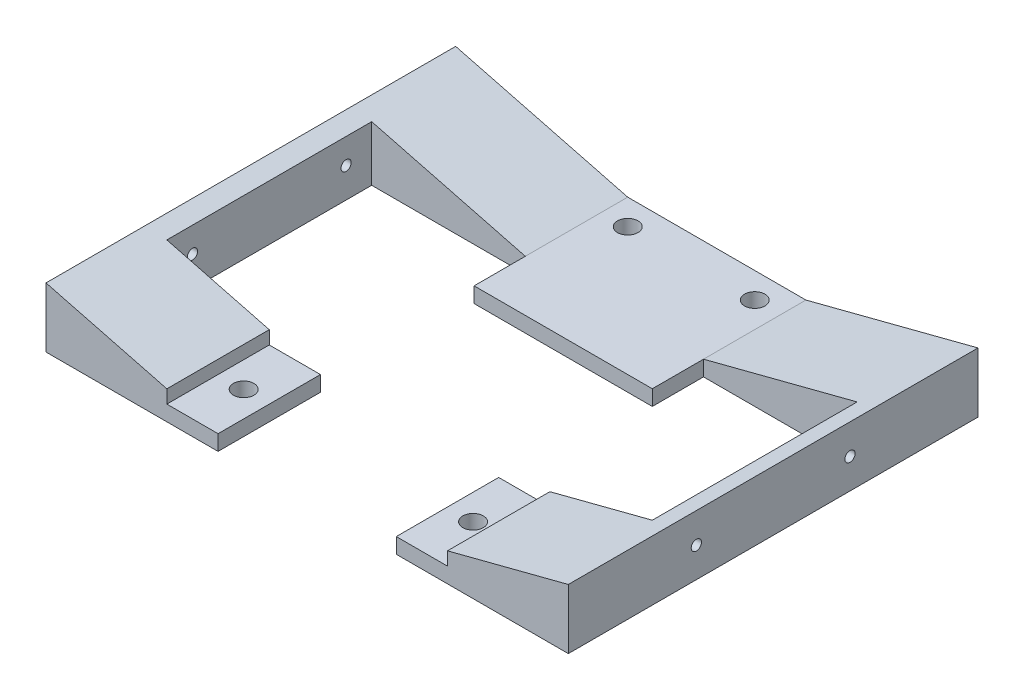
ISO-10303-21;
HEADER;
FILE_DESCRIPTION(('STEP AP214'),'2;1');
FILE_NAME('part.step','',(''),(''),'','','');
FILE_SCHEMA(('AUTOMOTIVE_DESIGN { 1 0 10303 214 1 1 1 1 }'));
ENDSEC;
DATA;
#1=APPLICATION_CONTEXT('core data for automotive mechanical design processes');
#2=APPLICATION_PROTOCOL_DEFINITION('international standard','automotive_design',2000,#1);
#3=PRODUCT_CONTEXT('',#1,'mechanical');
#4=PRODUCT('Part','Part','',(#3));
#5=PRODUCT_RELATED_PRODUCT_CATEGORY('part','',(#4));
#6=PRODUCT_DEFINITION_FORMATION('','',#4);
#7=PRODUCT_DEFINITION_CONTEXT('part definition',#1,'design');
#8=PRODUCT_DEFINITION('design','',#6,#7);
#9=PRODUCT_DEFINITION_SHAPE('','',#8);
#10=(LENGTH_UNIT() NAMED_UNIT(*) SI_UNIT(.MILLI.,.METRE.));
#11=(NAMED_UNIT(*) PLANE_ANGLE_UNIT() SI_UNIT($,.RADIAN.));
#12=(NAMED_UNIT(*) SI_UNIT($,.STERADIAN.) SOLID_ANGLE_UNIT());
#13=UNCERTAINTY_MEASURE_WITH_UNIT(LENGTH_MEASURE(1.E-05),#10,'distance_accuracy_value','');
#14=(GEOMETRIC_REPRESENTATION_CONTEXT(3) GLOBAL_UNCERTAINTY_ASSIGNED_CONTEXT((#13)) GLOBAL_UNIT_ASSIGNED_CONTEXT((#10,
#11,#12)) REPRESENTATION_CONTEXT('',''));
#15=CARTESIAN_POINT('',(0.,0.,0.));
#16=DIRECTION('',(0.,0.,1.));
#17=DIRECTION('',(1.,0.,0.));
#18=AXIS2_PLACEMENT_3D('',#15,#16,#17);
#19=CARTESIAN_POINT('',(-129.54,-34.798,-101.6));
#20=DIRECTION('',(0.,-1.,0.));
#21=DIRECTION('',(0.,0.,-1.));
#22=AXIS2_PLACEMENT_3D('',#19,#20,#21);
#23=PLANE('',#22);
#24=CARTESIAN_POINT('',(56.896,-34.798,76.2));
#25=DIRECTION('',(0.,1.,0.));
#26=DIRECTION('',(0.,0.,1.));
#27=AXIS2_PLACEMENT_3D('',#24,#25,#26);
#28=CIRCLE('',#27,5.08);
#29=CARTESIAN_POINT('',(56.896,-34.798,81.28));
#30=VERTEX_POINT('',#29);
#31=EDGE_CURVE('E555',#30,#30,#28,.T.);
#32=ORIENTED_EDGE('',*,*,#31,.T.);
#33=EDGE_LOOP('',(#32));
#34=FACE_BOUND('',#33,.T.);
#35=CARTESIAN_POINT('',(-56.896,-34.798,76.2));
#36=DIRECTION('',(0.,1.,0.));
#37=DIRECTION('',(-1.,0.,0.));
#38=AXIS2_PLACEMENT_3D('',#35,#36,#37);
#39=CIRCLE('',#38,5.08000000000001);
#40=CARTESIAN_POINT('',(-61.976,-34.798,76.2));
#41=VERTEX_POINT('',#40);
#42=EDGE_CURVE('E284',#41,#41,#39,.T.);
#43=ORIENTED_EDGE('',*,*,#42,.T.);
#44=EDGE_LOOP('',(#43));
#45=FACE_BOUND('',#44,.T.);
#46=CARTESIAN_POINT('',(31.496,-34.798,-88.9));
#47=DIRECTION('',(0.,-1.,0.));
#48=DIRECTION('',(1.,0.,0.));
#49=AXIS2_PLACEMENT_3D('',#46,#47,#48);
#50=CIRCLE('',#49,5.08000000000001);
#51=CARTESIAN_POINT('',(36.576,-34.798,-88.9));
#52=VERTEX_POINT('',#51);
#53=EDGE_CURVE('E289',#52,#52,#50,.T.);
#54=ORIENTED_EDGE('',*,*,#53,.F.);
#55=EDGE_LOOP('',(#54));
#56=FACE_BOUND('',#55,.T.);
#57=DIRECTION('',(0.,0.,-1.));
#58=VECTOR('',#57,1.);
#59=CARTESIAN_POINT('',(-120.396,-34.798,50.8));
#60=LINE('',#59,#58);
#61=CARTESIAN_POINT('',(-120.396,-34.798,50.8));
#62=VERTEX_POINT('',#61);
#63=CARTESIAN_POINT('',(-120.396,-34.798,-50.8));
#64=VERTEX_POINT('',#63);
#65=EDGE_CURVE('E337',#62,#64,#60,.T.);
#66=ORIENTED_EDGE('',*,*,#65,.F.);
#67=DIRECTION('',(1.,0.,0.));
#68=VECTOR('',#67,1.);
#69=CARTESIAN_POINT('',(-44.196,-34.798,50.8));
#70=LINE('',#69,#68);
#71=CARTESIAN_POINT('',(-44.196,-34.798,50.8));
#72=VERTEX_POINT('',#71);
#73=EDGE_CURVE('E331',#62,#72,#70,.T.);
#74=ORIENTED_EDGE('',*,*,#73,.T.);
#75=DIRECTION('',(0.,0.,1.));
#76=VECTOR('',#75,1.);
#77=CARTESIAN_POINT('',(-44.196,-34.798,-25.4));
#78=LINE('',#77,#76);
#79=CARTESIAN_POINT('',(-44.196,-34.798,101.6));
#80=VERTEX_POINT('',#79);
#81=EDGE_CURVE('E208',#72,#80,#78,.T.);
#82=ORIENTED_EDGE('',*,*,#81,.T.);
#83=DIRECTION('',(1.,0.,0.));
#84=VECTOR('',#83,1.);
#85=CARTESIAN_POINT('',(-129.54,-34.798,101.6));
#86=LINE('',#85,#84);
#87=CARTESIAN_POINT('',(-129.54,-34.798,101.6));
#88=VERTEX_POINT('',#87);
#89=EDGE_CURVE('E214',#88,#80,#86,.T.);
#90=ORIENTED_EDGE('',*,*,#89,.F.);
#91=DIRECTION('',(0.,0.,1.));
#92=VECTOR('',#91,1.);
#93=CARTESIAN_POINT('',(-129.54,-34.798,-101.6));
#94=LINE('',#93,#92);
#95=CARTESIAN_POINT('',(-129.54,-34.798,-101.6));
#96=VERTEX_POINT('',#95);
#97=EDGE_CURVE('E250',#96,#88,#94,.T.);
#98=ORIENTED_EDGE('',*,*,#97,.F.);
#99=DIRECTION('',(1.,0.,0.));
#100=VECTOR('',#99,1.);
#101=CARTESIAN_POINT('',(-129.54,-34.798,-101.6));
#102=LINE('',#101,#100);
#103=CARTESIAN_POINT('',(129.54,-34.798,-101.6));
#104=VERTEX_POINT('',#103);
#105=EDGE_CURVE('E231',#96,#104,#102,.T.);
#106=ORIENTED_EDGE('',*,*,#105,.T.);
#107=DIRECTION('',(0.,0.,1.));
#108=VECTOR('',#107,1.);
#109=CARTESIAN_POINT('',(129.54,-34.798,-101.6));
#110=LINE('',#109,#108);
#111=CARTESIAN_POINT('',(129.54,-34.798,101.6));
#112=VERTEX_POINT('',#111);
#113=EDGE_CURVE('E247',#104,#112,#110,.T.);
#114=ORIENTED_EDGE('',*,*,#113,.T.);
#115=CARTESIAN_POINT('',(44.196,-34.798,101.6));
#116=VERTEX_POINT('',#115);
#117=EDGE_CURVE('E206',#116,#112,#86,.T.);
#118=ORIENTED_EDGE('',*,*,#117,.F.);
#119=DIRECTION('',(0.,0.,1.));
#120=VECTOR('',#119,1.);
#121=CARTESIAN_POINT('',(44.196,-34.798,-25.4));
#122=LINE('',#121,#120);
#123=CARTESIAN_POINT('',(44.196,-34.798,50.8));
#124=VERTEX_POINT('',#123);
#125=EDGE_CURVE('E204',#124,#116,#122,.T.);
#126=ORIENTED_EDGE('',*,*,#125,.F.);
#127=DIRECTION('',(1.,0.,0.));
#128=VECTOR('',#127,1.);
#129=CARTESIAN_POINT('',(120.396,-34.798,50.8));
#130=LINE('',#129,#128);
#131=CARTESIAN_POINT('',(120.396,-34.798,50.8));
#132=VERTEX_POINT('',#131);
#133=EDGE_CURVE('E359',#124,#132,#130,.T.);
#134=ORIENTED_EDGE('',*,*,#133,.T.);
#135=DIRECTION('',(0.,0.,-1.));
#136=VECTOR('',#135,1.);
#137=CARTESIAN_POINT('',(120.396,-34.798,50.8));
#138=LINE('',#137,#136);
#139=CARTESIAN_POINT('',(120.396,-34.798,-50.8));
#140=VERTEX_POINT('',#139);
#141=EDGE_CURVE('E346',#132,#140,#138,.T.);
#142=ORIENTED_EDGE('',*,*,#141,.T.);
#143=DIRECTION('',(1.,0.,0.));
#144=VECTOR('',#143,1.);
#145=CARTESIAN_POINT('',(120.396,-34.798,-50.8));
#146=LINE('',#145,#144);
#147=CARTESIAN_POINT('',(44.196,-34.798,-50.8));
#148=VERTEX_POINT('',#147);
#149=EDGE_CURVE('E371',#148,#140,#146,.T.);
#150=ORIENTED_EDGE('',*,*,#149,.F.);
#151=DIRECTION('',(0.,0.,-1.));
#152=VECTOR('',#151,1.);
#153=CARTESIAN_POINT('',(44.196,-34.798,50.8));
#154=LINE('',#153,#152);
#155=CARTESIAN_POINT('',(44.196,-34.798,-25.4));
#156=VERTEX_POINT('',#155);
#157=EDGE_CURVE('E309',#156,#148,#154,.T.);
#158=ORIENTED_EDGE('',*,*,#157,.F.);
#159=DIRECTION('',(1.,0.,0.));
#160=VECTOR('',#159,1.);
#161=CARTESIAN_POINT('',(-44.196,-34.798,-25.4));
#162=LINE('',#161,#160);
#163=CARTESIAN_POINT('',(-44.196,-34.798,-25.4));
#164=VERTEX_POINT('',#163);
#165=EDGE_CURVE('E386',#164,#156,#162,.T.);
#166=ORIENTED_EDGE('',*,*,#165,.F.);
#167=DIRECTION('',(0.,0.,-1.));
#168=VECTOR('',#167,1.);
#169=CARTESIAN_POINT('',(-44.196,-34.798,50.8));
#170=LINE('',#169,#168);
#171=CARTESIAN_POINT('',(-44.196,-34.798,-50.8));
#172=VERTEX_POINT('',#171);
#173=EDGE_CURVE('E334',#164,#172,#170,.T.);
#174=ORIENTED_EDGE('',*,*,#173,.T.);
#175=DIRECTION('',(1.,0.,0.));
#176=VECTOR('',#175,1.);
#177=CARTESIAN_POINT('',(-44.196,-34.798,-50.8));
#178=LINE('',#177,#176);
#179=EDGE_CURVE('E321',#64,#172,#178,.T.);
#180=ORIENTED_EDGE('',*,*,#179,.F.);
#181=EDGE_LOOP('',(#66,#74,#82,#90,#98,#106,#114,#118,#126,#134,#142,#150,#158,#166,#174,#180));
#182=FACE_BOUND('',#181,.T.);
#183=CARTESIAN_POINT('',(-31.496,-34.798,-88.9));
#184=DIRECTION('',(0.,1.,0.));
#185=DIRECTION('',(-1.,0.,0.));
#186=AXIS2_PLACEMENT_3D('',#183,#184,#185);
#187=CIRCLE('',#186,5.08);
#188=CARTESIAN_POINT('',(-36.576,-34.798,-88.9));
#189=VERTEX_POINT('',#188);
#190=EDGE_CURVE('E197',#189,#189,#187,.T.);
#191=ORIENTED_EDGE('',*,*,#190,.T.);
#192=EDGE_LOOP('',(#191));
#193=FACE_BOUND('',#192,.T.);
#194=ADVANCED_FACE('F38',(#34,#45,#56,#182,#193),#23,.T.);
#195=CARTESIAN_POINT('',(-44.196,-27.178,-101.6));
#196=DIRECTION('',(0.,1.,0.));
#197=DIRECTION('',(-1.,0.,0.));
#198=AXIS2_PLACEMENT_3D('',#195,#196,#197);
#199=PLANE('',#198);
#200=CARTESIAN_POINT('',(31.496,-27.178,-88.9));
#201=DIRECTION('',(0.,-1.,0.));
#202=DIRECTION('',(1.,0.,0.));
#203=AXIS2_PLACEMENT_3D('',#200,#201,#202);
#204=CIRCLE('',#203,5.08000000000001);
#205=CARTESIAN_POINT('',(36.576,-27.178,-88.9));
#206=VERTEX_POINT('',#205);
#207=EDGE_CURVE('E295',#206,#206,#204,.T.);
#208=ORIENTED_EDGE('',*,*,#207,.T.);
#209=EDGE_LOOP('',(#208));
#210=FACE_BOUND('',#209,.T.);
#211=DIRECTION('',(0.,0.,1.));
#212=VECTOR('',#211,1.);
#213=CARTESIAN_POINT('',(-44.196,-27.178,-101.6));
#214=LINE('',#213,#212);
#215=CARTESIAN_POINT('',(-44.196,-27.178,-101.6));
#216=VERTEX_POINT('',#215);
#217=CARTESIAN_POINT('',(-44.196,-27.178,-50.8));
#218=VERTEX_POINT('',#217);
#219=EDGE_CURVE('E240',#216,#218,#214,.T.);
#220=ORIENTED_EDGE('',*,*,#219,.T.);
#221=DIRECTION('',(0.,0.,-1.));
#222=VECTOR('',#221,1.);
#223=CARTESIAN_POINT('',(-44.196,-27.178,50.8));
#224=LINE('',#223,#222);
#225=CARTESIAN_POINT('',(-44.196,-27.178,-25.4));
#226=VERTEX_POINT('',#225);
#227=EDGE_CURVE('E342',#226,#218,#224,.T.);
#228=ORIENTED_EDGE('',*,*,#227,.F.);
#229=DIRECTION('',(-1.,0.,0.));
#230=VECTOR('',#229,1.);
#231=CARTESIAN_POINT('',(44.196,-27.178,-25.4));
#232=LINE('',#231,#230);
#233=CARTESIAN_POINT('',(44.196,-27.178,-25.4));
#234=VERTEX_POINT('',#233);
#235=EDGE_CURVE('E379',#234,#226,#232,.T.);
#236=ORIENTED_EDGE('',*,*,#235,.F.);
#237=DIRECTION('',(0.,0.,-1.));
#238=VECTOR('',#237,1.);
#239=CARTESIAN_POINT('',(44.196,-27.178,50.8));
#240=LINE('',#239,#238);
#241=CARTESIAN_POINT('',(44.196,-27.178,-50.8));
#242=VERTEX_POINT('',#241);
#243=EDGE_CURVE('E351',#234,#242,#240,.T.);
#244=ORIENTED_EDGE('',*,*,#243,.T.);
#245=DIRECTION('',(0.,0.,1.));
#246=VECTOR('',#245,1.);
#247=CARTESIAN_POINT('',(44.196,-27.178,-101.6));
#248=LINE('',#247,#246);
#249=CARTESIAN_POINT('',(44.196,-27.178,-101.6));
#250=VERTEX_POINT('',#249);
#251=EDGE_CURVE('E241',#250,#242,#248,.T.);
#252=ORIENTED_EDGE('',*,*,#251,.F.);
#253=DIRECTION('',(-1.,0.,0.));
#254=VECTOR('',#253,1.);
#255=CARTESIAN_POINT('',(-44.196,-27.178,-101.6));
#256=LINE('',#255,#254);
#257=EDGE_CURVE('E223',#250,#216,#256,.T.);
#258=ORIENTED_EDGE('',*,*,#257,.T.);
#259=EDGE_LOOP('',(#220,#228,#236,#244,#252,#258));
#260=FACE_BOUND('',#259,.T.);
#261=CARTESIAN_POINT('',(-31.496,-27.178,-88.9));
#262=DIRECTION('',(0.,1.,0.));
#263=DIRECTION('',(-1.,0.,0.));
#264=AXIS2_PLACEMENT_3D('',#261,#262,#263);
#265=CIRCLE('',#264,5.08);
#266=CARTESIAN_POINT('',(-36.576,-27.178,-88.9));
#267=VERTEX_POINT('',#266);
#268=EDGE_CURVE('E292',#267,#267,#265,.T.);
#269=ORIENTED_EDGE('',*,*,#268,.F.);
#270=EDGE_LOOP('',(#269));
#271=FACE_BOUND('',#270,.T.);
#272=ADVANCED_FACE('F40',(#210,#260,#271),#199,.T.);
#273=CARTESIAN_POINT('',(-129.54,-5.08,-101.6));
#274=DIRECTION('',(0.250662178698064,0.968074621178729,0.));
#275=DIRECTION('',(-0.968074621178729,0.250662178698064,0.));
#276=AXIS2_PLACEMENT_3D('',#273,#274,#275);
#277=PLANE('',#276);
#278=DIRECTION('',(0.,0.,1.));
#279=VECTOR('',#278,1.);
#280=CARTESIAN_POINT('',(-69.596,-20.6012142857143,48.514));
#281=LINE('',#280,#279);
#282=CARTESIAN_POINT('',(-69.596,-20.6012142857143,50.8));
#283=VERTEX_POINT('',#282);
#284=CARTESIAN_POINT('',(-69.596,-20.6012142857143,101.6));
#285=VERTEX_POINT('',#284);
#286=EDGE_CURVE('E180',#283,#285,#281,.T.);
#287=ORIENTED_EDGE('',*,*,#286,.F.);
#288=DIRECTION('',(-0.968074621178729,0.250662178698064,0.));
#289=VECTOR('',#288,1.);
#290=CARTESIAN_POINT('',(-44.196,-27.178,50.8));
#291=LINE('',#290,#289);
#292=CARTESIAN_POINT('',(-120.396,-7.44764285714285,50.8));
#293=VERTEX_POINT('',#292);
#294=EDGE_CURVE('E327',#283,#293,#291,.T.);
#295=ORIENTED_EDGE('',*,*,#294,.T.);
#296=DIRECTION('',(0.,0.,-1.));
#297=VECTOR('',#296,1.);
#298=CARTESIAN_POINT('',(-120.396,-7.44764285714285,50.8));
#299=LINE('',#298,#297);
#300=CARTESIAN_POINT('',(-120.396,-7.44764285714285,-50.8));
#301=VERTEX_POINT('',#300);
#302=EDGE_CURVE('E339',#293,#301,#299,.T.);
#303=ORIENTED_EDGE('',*,*,#302,.T.);
#304=DIRECTION('',(-0.968074621178729,0.250662178698064,0.));
#305=VECTOR('',#304,1.);
#306=CARTESIAN_POINT('',(-44.196,-27.178,-50.8));
#307=LINE('',#306,#305);
#308=EDGE_CURVE('E314',#218,#301,#307,.T.);
#309=ORIENTED_EDGE('',*,*,#308,.F.);
#310=ORIENTED_EDGE('',*,*,#219,.F.);
#311=DIRECTION('',(-0.968074621178729,0.250662178698064,0.));
#312=VECTOR('',#311,1.);
#313=CARTESIAN_POINT('',(-129.54,-5.08,-101.6));
#314=LINE('',#313,#312);
#315=CARTESIAN_POINT('',(-129.54,-5.08,-101.6));
#316=VERTEX_POINT('',#315);
#317=EDGE_CURVE('E226',#216,#316,#314,.T.);
#318=ORIENTED_EDGE('',*,*,#317,.T.);
#319=DIRECTION('',(0.,0.,1.));
#320=VECTOR('',#319,1.);
#321=CARTESIAN_POINT('',(-129.54,-5.08,-101.6));
#322=LINE('',#321,#320);
#323=CARTESIAN_POINT('',(-129.54,-5.08,101.6));
#324=VERTEX_POINT('',#323);
#325=EDGE_CURVE('E201',#316,#324,#322,.T.);
#326=ORIENTED_EDGE('',*,*,#325,.T.);
#327=DIRECTION('',(-0.968074621178729,0.250662178698064,0.));
#328=VECTOR('',#327,1.);
#329=CARTESIAN_POINT('',(-129.54,-5.08,101.6));
#330=LINE('',#329,#328);
#331=EDGE_CURVE('E194',#285,#324,#330,.T.);
#332=ORIENTED_EDGE('',*,*,#331,.F.);
#333=EDGE_LOOP('',(#287,#295,#303,#309,#310,#318,#326,#332));
#334=FACE_BOUND('',#333,.T.);
#335=ADVANCED_FACE('F199',(#334),#277,.T.);
#336=CARTESIAN_POINT('',(-44.196,-27.178,-25.4));
#337=DIRECTION('',(-1.,0.,0.));
#338=DIRECTION('',(0.,0.,1.));
#339=AXIS2_PLACEMENT_3D('',#336,#337,#338);
#340=PLANE('',#339);
#341=DIRECTION('',(0.,1.,0.));
#342=VECTOR('',#341,1.);
#343=CARTESIAN_POINT('',(-44.196,-27.178,50.8));
#344=LINE('',#343,#342);
#345=CARTESIAN_POINT('',(-44.196,-27.178,50.8));
#346=VERTEX_POINT('',#345);
#347=EDGE_CURVE('E324',#72,#346,#344,.T.);
#348=ORIENTED_EDGE('',*,*,#347,.T.);
#349=DIRECTION('',(0.,0.,1.));
#350=VECTOR('',#349,1.);
#351=CARTESIAN_POINT('',(-44.196,-27.178,-25.4));
#352=LINE('',#351,#350);
#353=CARTESIAN_POINT('',(-44.196,-27.178,101.6));
#354=VERTEX_POINT('',#353);
#355=EDGE_CURVE('E393',#346,#354,#352,.T.);
#356=ORIENTED_EDGE('',*,*,#355,.T.);
#357=DIRECTION('',(0.,-1.,0.));
#358=VECTOR('',#357,1.);
#359=CARTESIAN_POINT('',(-44.196,-27.178,101.6));
#360=LINE('',#359,#358);
#361=EDGE_CURVE('E380',#354,#80,#360,.T.);
#362=ORIENTED_EDGE('',*,*,#361,.T.);
#363=ORIENTED_EDGE('',*,*,#81,.F.);
#364=EDGE_LOOP('',(#348,#356,#362,#363));
#365=FACE_BOUND('',#364,.T.);
#366=ADVANCED_FACE('F456',(#365),#340,.F.);
#367=CARTESIAN_POINT('',(0.,0.,101.6));
#368=DIRECTION('',(0.,0.,1.));
#369=DIRECTION('',(1.,0.,0.));
#370=AXIS2_PLACEMENT_3D('',#367,#368,#369);
#371=PLANE('',#370);
#372=DIRECTION('',(0.,1.,0.));
#373=VECTOR('',#372,1.);
#374=CARTESIAN_POINT('',(69.596,-27.178,101.6));
#375=LINE('',#374,#373);
#376=CARTESIAN_POINT('',(69.596,-27.178,101.6));
#377=VERTEX_POINT('',#376);
#378=CARTESIAN_POINT('',(69.596,-20.6012142857143,101.6));
#379=VERTEX_POINT('',#378);
#380=EDGE_CURVE('E304',#377,#379,#375,.T.);
#381=ORIENTED_EDGE('',*,*,#380,.F.);
#382=DIRECTION('',(1.,0.,0.));
#383=VECTOR('',#382,1.);
#384=CARTESIAN_POINT('',(44.196,-27.178,101.6));
#385=LINE('',#384,#383);
#386=CARTESIAN_POINT('',(44.196,-27.178,101.6));
#387=VERTEX_POINT('',#386);
#388=EDGE_CURVE('E301',#387,#377,#385,.T.);
#389=ORIENTED_EDGE('',*,*,#388,.F.);
#390=DIRECTION('',(0.,1.,0.));
#391=VECTOR('',#390,1.);
#392=CARTESIAN_POINT('',(44.196,-27.178,101.6));
#393=LINE('',#392,#391);
#394=EDGE_CURVE('E344',#116,#387,#393,.T.);
#395=ORIENTED_EDGE('',*,*,#394,.F.);
#396=ORIENTED_EDGE('',*,*,#117,.T.);
#397=DIRECTION('',(0.,1.,0.));
#398=VECTOR('',#397,1.);
#399=CARTESIAN_POINT('',(129.54,-34.798,101.6));
#400=LINE('',#399,#398);
#401=CARTESIAN_POINT('',(129.54,-5.08,101.6));
#402=VERTEX_POINT('',#401);
#403=EDGE_CURVE('E217',#112,#402,#400,.T.);
#404=ORIENTED_EDGE('',*,*,#403,.T.);
#405=DIRECTION('',(-0.968074621178729,-0.250662178698064,0.));
#406=VECTOR('',#405,1.);
#407=CARTESIAN_POINT('',(44.196,-27.178,101.6));
#408=LINE('',#407,#406);
#409=EDGE_CURVE('E220',#402,#379,#408,.T.);
#410=ORIENTED_EDGE('',*,*,#409,.T.);
#411=EDGE_LOOP('',(#381,#389,#395,#396,#404,#410));
#412=FACE_BOUND('',#411,.T.);
#413=ADVANCED_FACE('F404',(#412),#371,.T.);
#414=CARTESIAN_POINT('',(44.196,-27.178,-101.6));
#415=DIRECTION('',(-0.250662178698064,0.968074621178729,0.));
#416=DIRECTION('',(-0.968074621178729,-0.250662178698064,0.));
#417=AXIS2_PLACEMENT_3D('',#414,#415,#416);
#418=PLANE('',#417);
#419=DIRECTION('',(0.,0.,1.));
#420=VECTOR('',#419,1.);
#421=CARTESIAN_POINT('',(69.596,-20.6012142857143,48.514));
#422=LINE('',#421,#420);
#423=CARTESIAN_POINT('',(69.596,-20.6012142857143,50.8));
#424=VERTEX_POINT('',#423);
#425=EDGE_CURVE('E306',#424,#379,#422,.T.);
#426=ORIENTED_EDGE('',*,*,#425,.T.);
#427=ORIENTED_EDGE('',*,*,#409,.F.);
#428=DIRECTION('',(0.,0.,1.));
#429=VECTOR('',#428,1.);
#430=CARTESIAN_POINT('',(129.54,-5.08,-101.6));
#431=LINE('',#430,#429);
#432=CARTESIAN_POINT('',(129.54,-5.08,-101.6));
#433=VERTEX_POINT('',#432);
#434=EDGE_CURVE('E245',#433,#402,#431,.T.);
#435=ORIENTED_EDGE('',*,*,#434,.F.);
#436=DIRECTION('',(-0.968074621178729,-0.250662178698064,0.));
#437=VECTOR('',#436,1.);
#438=CARTESIAN_POINT('',(44.196,-27.178,-101.6));
#439=LINE('',#438,#437);
#440=EDGE_CURVE('E237',#433,#250,#439,.T.);
#441=ORIENTED_EDGE('',*,*,#440,.T.);
#442=ORIENTED_EDGE('',*,*,#251,.T.);
#443=DIRECTION('',(-0.968074621178729,-0.250662178698064,0.));
#444=VECTOR('',#443,1.);
#445=CARTESIAN_POINT('',(120.396,-7.44764285714286,-50.8));
#446=LINE('',#445,#444);
#447=CARTESIAN_POINT('',(120.396,-7.44764285714286,-50.8));
#448=VERTEX_POINT('',#447);
#449=EDGE_CURVE('E365',#448,#242,#446,.T.);
#450=ORIENTED_EDGE('',*,*,#449,.F.);
#451=DIRECTION('',(0.,0.,-1.));
#452=VECTOR('',#451,1.);
#453=CARTESIAN_POINT('',(120.396,-7.44764285714286,50.8));
#454=LINE('',#453,#452);
#455=CARTESIAN_POINT('',(120.396,-7.44764285714286,50.8));
#456=VERTEX_POINT('',#455);
#457=EDGE_CURVE('E349',#456,#448,#454,.T.);
#458=ORIENTED_EDGE('',*,*,#457,.F.);
#459=DIRECTION('',(-0.968074621178729,-0.250662178698064,0.));
#460=VECTOR('',#459,1.);
#461=CARTESIAN_POINT('',(120.396,-7.44764285714286,50.8));
#462=LINE('',#461,#460);
#463=EDGE_CURVE('E354',#456,#424,#462,.T.);
#464=ORIENTED_EDGE('',*,*,#463,.T.);
#465=EDGE_LOOP('',(#426,#427,#435,#441,#442,#450,#458,#464));
#466=FACE_BOUND('',#465,.T.);
#467=ADVANCED_FACE('F415',(#466),#418,.T.);
#468=CARTESIAN_POINT('',(129.54,-34.798,-101.6));
#469=DIRECTION('',(1.,0.,0.));
#470=DIRECTION('',(0.,0.,-1.));
#471=AXIS2_PLACEMENT_3D('',#468,#469,#470);
#472=PLANE('',#471);
#473=CARTESIAN_POINT('',(129.54,-19.939,38.1));
#474=DIRECTION('',(-1.,0.,0.));
#475=DIRECTION('',(0.,0.,1.));
#476=AXIS2_PLACEMENT_3D('',#473,#474,#475);
#477=CIRCLE('',#476,2.54);
#478=CARTESIAN_POINT('',(129.54,-19.939,40.64));
#479=VERTEX_POINT('',#478);
#480=EDGE_CURVE('E263',#479,#479,#477,.T.);
#481=ORIENTED_EDGE('',*,*,#480,.T.);
#482=EDGE_LOOP('',(#481));
#483=FACE_BOUND('',#482,.T.);
#484=CARTESIAN_POINT('',(129.54,-19.939,-38.1000000000001));
#485=DIRECTION('',(-1.,0.,0.));
#486=DIRECTION('',(0.,0.,-1.));
#487=AXIS2_PLACEMENT_3D('',#484,#485,#486);
#488=CIRCLE('',#487,2.54);
#489=CARTESIAN_POINT('',(129.54,-19.939,-40.6400000000001));
#490=VERTEX_POINT('',#489);
#491=EDGE_CURVE('E282',#490,#490,#488,.T.);
#492=ORIENTED_EDGE('',*,*,#491,.T.);
#493=EDGE_LOOP('',(#492));
#494=FACE_BOUND('',#493,.T.);
#495=ORIENTED_EDGE('',*,*,#434,.T.);
#496=ORIENTED_EDGE('',*,*,#403,.F.);
#497=ORIENTED_EDGE('',*,*,#113,.F.);
#498=DIRECTION('',(0.,1.,0.));
#499=VECTOR('',#498,1.);
#500=CARTESIAN_POINT('',(129.54,-34.798,-101.6));
#501=LINE('',#500,#499);
#502=EDGE_CURVE('E234',#104,#433,#501,.T.);
#503=ORIENTED_EDGE('',*,*,#502,.T.);
#504=EDGE_LOOP('',(#495,#496,#497,#503));
#505=FACE_BOUND('',#504,.T.);
#506=ADVANCED_FACE('F467',(#483,#494,#505),#472,.T.);
#507=CARTESIAN_POINT('',(-129.54,-5.08,-101.6));
#508=DIRECTION('',(-1.,0.,0.));
#509=DIRECTION('',(0.,0.,1.));
#510=AXIS2_PLACEMENT_3D('',#507,#508,#509);
#511=PLANE('',#510);
#512=CARTESIAN_POINT('',(-129.54,-19.939,38.1));
#513=DIRECTION('',(-1.,0.,0.));
#514=DIRECTION('',(0.,0.,1.));
#515=AXIS2_PLACEMENT_3D('',#512,#513,#514);
#516=CIRCLE('',#515,2.54);
#517=CARTESIAN_POINT('',(-129.54,-19.939,40.64));
#518=VERTEX_POINT('',#517);
#519=EDGE_CURVE('E269',#518,#518,#516,.T.);
#520=ORIENTED_EDGE('',*,*,#519,.F.);
#521=EDGE_LOOP('',(#520));
#522=FACE_BOUND('',#521,.T.);
#523=CARTESIAN_POINT('',(-129.54,-19.939,-38.1000000000001));
#524=DIRECTION('',(-1.,0.,0.));
#525=DIRECTION('',(0.,0.,-1.));
#526=AXIS2_PLACEMENT_3D('',#523,#524,#525);
#527=CIRCLE('',#526,2.54);
#528=CARTESIAN_POINT('',(-129.54,-19.939,-40.6400000000001));
#529=VERTEX_POINT('',#528);
#530=EDGE_CURVE('E274',#529,#529,#527,.T.);
#531=ORIENTED_EDGE('',*,*,#530,.F.);
#532=EDGE_LOOP('',(#531));
#533=FACE_BOUND('',#532,.T.);
#534=ORIENTED_EDGE('',*,*,#97,.T.);
#535=DIRECTION('',(0.,-1.,0.));
#536=VECTOR('',#535,1.);
#537=CARTESIAN_POINT('',(-129.54,-5.08,101.6));
#538=LINE('',#537,#536);
#539=EDGE_CURVE('E203',#324,#88,#538,.T.);
#540=ORIENTED_EDGE('',*,*,#539,.F.);
#541=ORIENTED_EDGE('',*,*,#325,.F.);
#542=DIRECTION('',(0.,-1.,0.));
#543=VECTOR('',#542,1.);
#544=CARTESIAN_POINT('',(-129.54,-5.08,-101.6));
#545=LINE('',#544,#543);
#546=EDGE_CURVE('E228',#316,#96,#545,.T.);
#547=ORIENTED_EDGE('',*,*,#546,.T.);
#548=EDGE_LOOP('',(#534,#540,#541,#547));
#549=FACE_BOUND('',#548,.T.);
#550=ADVANCED_FACE('F465',(#522,#533,#549),#511,.T.);
#551=CARTESIAN_POINT('',(0.,0.,-101.6));
#552=DIRECTION('',(0.,0.,1.));
#553=DIRECTION('',(1.,0.,0.));
#554=AXIS2_PLACEMENT_3D('',#551,#552,#553);
#555=PLANE('',#554);
#556=ORIENTED_EDGE('',*,*,#257,.F.);
#557=ORIENTED_EDGE('',*,*,#440,.F.);
#558=ORIENTED_EDGE('',*,*,#502,.F.);
#559=ORIENTED_EDGE('',*,*,#105,.F.);
#560=ORIENTED_EDGE('',*,*,#546,.F.);
#561=ORIENTED_EDGE('',*,*,#317,.F.);
#562=EDGE_LOOP('',(#556,#557,#558,#559,#560,#561));
#563=FACE_BOUND('',#562,.T.);
#564=ADVANCED_FACE('F463',(#563),#555,.F.);
#565=DIRECTION('',(1.,0.,0.));
#566=VECTOR('',#565,1.);
#567=CARTESIAN_POINT('',(-44.196,-27.178,101.6));
#568=LINE('',#567,#566);
#569=CARTESIAN_POINT('',(-69.596,-27.178,101.6));
#570=VERTEX_POINT('',#569);
#571=EDGE_CURVE('E189',#570,#354,#568,.T.);
#572=ORIENTED_EDGE('',*,*,#571,.F.);
#573=DIRECTION('',(0.,-1.,0.));
#574=VECTOR('',#573,1.);
#575=CARTESIAN_POINT('',(-69.596,-27.178,101.6));
#576=LINE('',#575,#574);
#577=EDGE_CURVE('E183',#285,#570,#576,.T.);
#578=ORIENTED_EDGE('',*,*,#577,.F.);
#579=ORIENTED_EDGE('',*,*,#331,.T.);
#580=ORIENTED_EDGE('',*,*,#539,.T.);
#581=ORIENTED_EDGE('',*,*,#89,.T.);
#582=ORIENTED_EDGE('',*,*,#361,.F.);
#583=EDGE_LOOP('',(#572,#578,#579,#580,#581,#582));
#584=FACE_BOUND('',#583,.T.);
#585=ADVANCED_FACE('F192',(#584),#371,.T.);
#586=CARTESIAN_POINT('',(44.196,-27.178,-25.4));
#587=DIRECTION('',(1.,0.,0.));
#588=DIRECTION('',(0.,1.,0.));
#589=AXIS2_PLACEMENT_3D('',#586,#587,#588);
#590=PLANE('',#589);
#591=DIRECTION('',(0.,0.,1.));
#592=VECTOR('',#591,1.);
#593=CARTESIAN_POINT('',(44.196,-27.178,-25.4));
#594=LINE('',#593,#592);
#595=CARTESIAN_POINT('',(44.196,-27.178,50.8));
#596=VERTEX_POINT('',#595);
#597=EDGE_CURVE('E211',#596,#387,#594,.T.);
#598=ORIENTED_EDGE('',*,*,#597,.F.);
#599=DIRECTION('',(0.,-1.,0.));
#600=VECTOR('',#599,1.);
#601=CARTESIAN_POINT('',(44.196,-34.798,50.8));
#602=LINE('',#601,#600);
#603=EDGE_CURVE('E362',#596,#124,#602,.T.);
#604=ORIENTED_EDGE('',*,*,#603,.T.);
#605=ORIENTED_EDGE('',*,*,#125,.T.);
#606=ORIENTED_EDGE('',*,*,#394,.T.);
#607=EDGE_LOOP('',(#598,#604,#605,#606));
#608=FACE_BOUND('',#607,.T.);
#609=ADVANCED_FACE('F406',(#608),#590,.F.);
#610=CARTESIAN_POINT('',(0.,0.,-25.4));
#611=DIRECTION('',(0.,0.,1.));
#612=DIRECTION('',(1.,0.,0.));
#613=AXIS2_PLACEMENT_3D('',#610,#611,#612);
#614=PLANE('',#613);
#615=DIRECTION('',(0.,1.,0.));
#616=VECTOR('',#615,1.);
#617=CARTESIAN_POINT('',(44.196,-27.178,-25.4));
#618=LINE('',#617,#616);
#619=EDGE_CURVE('E376',#156,#234,#618,.T.);
#620=ORIENTED_EDGE('',*,*,#619,.T.);
#621=ORIENTED_EDGE('',*,*,#235,.T.);
#622=DIRECTION('',(0.,-1.,0.));
#623=VECTOR('',#622,1.);
#624=CARTESIAN_POINT('',(-44.196,-27.178,-25.4));
#625=LINE('',#624,#623);
#626=EDGE_CURVE('E383',#226,#164,#625,.T.);
#627=ORIENTED_EDGE('',*,*,#626,.T.);
#628=ORIENTED_EDGE('',*,*,#165,.T.);
#629=EDGE_LOOP('',(#620,#621,#627,#628));
#630=FACE_BOUND('',#629,.T.);
#631=ADVANCED_FACE('F435',(#630),#614,.T.);
#632=CARTESIAN_POINT('',(44.196,-34.798,50.8));
#633=DIRECTION('',(1.,0.,0.));
#634=DIRECTION('',(0.,1.,0.));
#635=AXIS2_PLACEMENT_3D('',#632,#633,#634);
#636=PLANE('',#635);
#637=ORIENTED_EDGE('',*,*,#157,.T.);
#638=DIRECTION('',(0.,-1.,0.));
#639=VECTOR('',#638,1.);
#640=CARTESIAN_POINT('',(44.196,-34.798,-50.8));
#641=LINE('',#640,#639);
#642=EDGE_CURVE('E315',#242,#148,#641,.T.);
#643=ORIENTED_EDGE('',*,*,#642,.F.);
#644=ORIENTED_EDGE('',*,*,#243,.F.);
#645=ORIENTED_EDGE('',*,*,#619,.F.);
#646=EDGE_LOOP('',(#637,#643,#644,#645));
#647=FACE_BOUND('',#646,.T.);
#648=ADVANCED_FACE('F432',(#647),#636,.T.);
#649=CARTESIAN_POINT('',(120.396,-7.44764285714286,50.8));
#650=DIRECTION('',(-1.,0.,0.));
#651=DIRECTION('',(0.,0.,1.));
#652=AXIS2_PLACEMENT_3D('',#649,#650,#651);
#653=PLANE('',#652);
#654=CARTESIAN_POINT('',(120.396,-19.939,38.1));
#655=DIRECTION('',(-1.,0.,0.));
#656=DIRECTION('',(0.,0.,1.));
#657=AXIS2_PLACEMENT_3D('',#654,#655,#656);
#658=CIRCLE('',#657,2.54);
#659=CARTESIAN_POINT('',(120.396,-19.939,40.64));
#660=VERTEX_POINT('',#659);
#661=EDGE_CURVE('E286',#660,#660,#658,.T.);
#662=ORIENTED_EDGE('',*,*,#661,.F.);
#663=EDGE_LOOP('',(#662));
#664=FACE_BOUND('',#663,.T.);
#665=CARTESIAN_POINT('',(120.396,-19.939,-38.1000000000001));
#666=DIRECTION('',(-1.,0.,0.));
#667=DIRECTION('',(0.,0.,1.));
#668=AXIS2_PLACEMENT_3D('',#665,#666,#667);
#669=CIRCLE('',#668,2.54);
#670=CARTESIAN_POINT('',(120.396,-19.939,-35.5600000000001));
#671=VERTEX_POINT('',#670);
#672=EDGE_CURVE('E262',#671,#671,#669,.T.);
#673=ORIENTED_EDGE('',*,*,#672,.F.);
#674=EDGE_LOOP('',(#673));
#675=FACE_BOUND('',#674,.T.);
#676=ORIENTED_EDGE('',*,*,#141,.F.);
#677=DIRECTION('',(0.,1.,0.));
#678=VECTOR('',#677,1.);
#679=CARTESIAN_POINT('',(120.396,-7.44764285714286,50.8));
#680=LINE('',#679,#678);
#681=EDGE_CURVE('E357',#132,#456,#680,.T.);
#682=ORIENTED_EDGE('',*,*,#681,.T.);
#683=ORIENTED_EDGE('',*,*,#457,.T.);
#684=DIRECTION('',(0.,1.,0.));
#685=VECTOR('',#684,1.);
#686=CARTESIAN_POINT('',(120.396,-7.44764285714286,-50.8));
#687=LINE('',#686,#685);
#688=EDGE_CURVE('E368',#140,#448,#687,.T.);
#689=ORIENTED_EDGE('',*,*,#688,.F.);
#690=EDGE_LOOP('',(#676,#682,#683,#689));
#691=FACE_BOUND('',#690,.T.);
#692=ADVANCED_FACE('F424',(#664,#675,#691),#653,.T.);
#693=CARTESIAN_POINT('',(0.,0.,50.8));
#694=DIRECTION('',(0.,0.,1.));
#695=DIRECTION('',(1.,0.,0.));
#696=AXIS2_PLACEMENT_3D('',#693,#694,#695);
#697=PLANE('',#696);
#698=DIRECTION('',(1.,0.,0.));
#699=VECTOR('',#698,1.);
#700=CARTESIAN_POINT('',(0.,-27.178,50.8));
#701=LINE('',#700,#699);
#702=CARTESIAN_POINT('',(69.596,-27.178,50.8));
#703=VERTEX_POINT('',#702);
#704=EDGE_CURVE('E244',#596,#703,#701,.T.);
#705=ORIENTED_EDGE('',*,*,#704,.T.);
#706=DIRECTION('',(0.,1.,0.));
#707=VECTOR('',#706,1.);
#708=CARTESIAN_POINT('',(69.596,0.,50.8));
#709=LINE('',#708,#707);
#710=EDGE_CURVE('E257',#703,#424,#709,.T.);
#711=ORIENTED_EDGE('',*,*,#710,.T.);
#712=ORIENTED_EDGE('',*,*,#463,.F.);
#713=ORIENTED_EDGE('',*,*,#681,.F.);
#714=ORIENTED_EDGE('',*,*,#133,.F.);
#715=ORIENTED_EDGE('',*,*,#603,.F.);
#716=EDGE_LOOP('',(#705,#711,#712,#713,#714,#715));
#717=FACE_BOUND('',#716,.T.);
#718=ADVANCED_FACE('F421',(#717),#697,.F.);
#719=CARTESIAN_POINT('',(0.,0.,-50.8));
#720=DIRECTION('',(0.,0.,1.));
#721=DIRECTION('',(1.,0.,0.));
#722=AXIS2_PLACEMENT_3D('',#719,#720,#721);
#723=PLANE('',#722);
#724=ORIENTED_EDGE('',*,*,#642,.T.);
#725=ORIENTED_EDGE('',*,*,#149,.T.);
#726=ORIENTED_EDGE('',*,*,#688,.T.);
#727=ORIENTED_EDGE('',*,*,#449,.T.);
#728=EDGE_LOOP('',(#724,#725,#726,#727));
#729=FACE_BOUND('',#728,.T.);
#730=ADVANCED_FACE('F429',(#729),#723,.T.);
#731=CARTESIAN_POINT('',(-44.196,-27.178,50.8));
#732=DIRECTION('',(-1.,0.,0.));
#733=DIRECTION('',(0.,0.,1.));
#734=AXIS2_PLACEMENT_3D('',#731,#732,#733);
#735=PLANE('',#734);
#736=ORIENTED_EDGE('',*,*,#227,.T.);
#737=DIRECTION('',(0.,1.,0.));
#738=VECTOR('',#737,1.);
#739=CARTESIAN_POINT('',(-44.196,-27.178,-50.8));
#740=LINE('',#739,#738);
#741=EDGE_CURVE('E311',#172,#218,#740,.T.);
#742=ORIENTED_EDGE('',*,*,#741,.F.);
#743=ORIENTED_EDGE('',*,*,#173,.F.);
#744=ORIENTED_EDGE('',*,*,#626,.F.);
#745=EDGE_LOOP('',(#736,#742,#743,#744));
#746=FACE_BOUND('',#745,.T.);
#747=ADVANCED_FACE('F440',(#746),#735,.T.);
#748=CARTESIAN_POINT('',(-120.396,-34.798,50.8));
#749=DIRECTION('',(1.,0.,0.));
#750=DIRECTION('',(0.,0.,-1.));
#751=AXIS2_PLACEMENT_3D('',#748,#749,#750);
#752=PLANE('',#751);
#753=CARTESIAN_POINT('',(-120.396,-19.939,38.1));
#754=DIRECTION('',(1.,0.,0.));
#755=DIRECTION('',(0.,0.,-1.));
#756=AXIS2_PLACEMENT_3D('',#753,#754,#755);
#757=CIRCLE('',#756,2.54);
#758=CARTESIAN_POINT('',(-120.396,-19.939,35.56));
#759=VERTEX_POINT('',#758);
#760=EDGE_CURVE('E42',#759,#759,#757,.T.);
#761=ORIENTED_EDGE('',*,*,#760,.F.);
#762=EDGE_LOOP('',(#761));
#763=FACE_BOUND('',#762,.T.);
#764=CARTESIAN_POINT('',(-120.396,-19.939,-38.1000000000001));
#765=DIRECTION('',(1.,0.,0.));
#766=DIRECTION('',(0.,0.,-1.));
#767=AXIS2_PLACEMENT_3D('',#764,#765,#766);
#768=CIRCLE('',#767,2.54);
#769=CARTESIAN_POINT('',(-120.396,-19.939,-40.6400000000001));
#770=VERTEX_POINT('',#769);
#771=EDGE_CURVE('E260',#770,#770,#768,.T.);
#772=ORIENTED_EDGE('',*,*,#771,.F.);
#773=EDGE_LOOP('',(#772));
#774=FACE_BOUND('',#773,.T.);
#775=ORIENTED_EDGE('',*,*,#302,.F.);
#776=DIRECTION('',(0.,-1.,0.));
#777=VECTOR('',#776,1.);
#778=CARTESIAN_POINT('',(-120.396,-34.798,50.8));
#779=LINE('',#778,#777);
#780=EDGE_CURVE('E329',#293,#62,#779,.T.);
#781=ORIENTED_EDGE('',*,*,#780,.T.);
#782=ORIENTED_EDGE('',*,*,#65,.T.);
#783=DIRECTION('',(0.,-1.,0.));
#784=VECTOR('',#783,1.);
#785=CARTESIAN_POINT('',(-120.396,-34.798,-50.8));
#786=LINE('',#785,#784);
#787=EDGE_CURVE('E318',#301,#64,#786,.T.);
#788=ORIENTED_EDGE('',*,*,#787,.F.);
#789=EDGE_LOOP('',(#775,#781,#782,#788));
#790=FACE_BOUND('',#789,.T.);
#791=ADVANCED_FACE('F449',(#763,#774,#790),#752,.T.);
#792=CARTESIAN_POINT('',(0.,0.,50.8));
#793=DIRECTION('',(0.,0.,-1.));
#794=DIRECTION('',(-1.,0.,0.));
#795=AXIS2_PLACEMENT_3D('',#792,#793,#794);
#796=PLANE('',#795);
#797=DIRECTION('',(-1.,0.,0.));
#798=VECTOR('',#797,1.);
#799=CARTESIAN_POINT('',(0.,-27.178,50.8));
#800=LINE('',#799,#798);
#801=CARTESIAN_POINT('',(-69.596,-27.178,50.8));
#802=VERTEX_POINT('',#801);
#803=EDGE_CURVE('E12',#346,#802,#800,.T.);
#804=ORIENTED_EDGE('',*,*,#803,.F.);
#805=ORIENTED_EDGE('',*,*,#347,.F.);
#806=ORIENTED_EDGE('',*,*,#73,.F.);
#807=ORIENTED_EDGE('',*,*,#780,.F.);
#808=ORIENTED_EDGE('',*,*,#294,.F.);
#809=DIRECTION('',(0.,1.,0.));
#810=VECTOR('',#809,1.);
#811=CARTESIAN_POINT('',(-69.596,0.,50.8));
#812=LINE('',#811,#810);
#813=EDGE_CURVE('E47',#802,#283,#812,.T.);
#814=ORIENTED_EDGE('',*,*,#813,.F.);
#815=EDGE_LOOP('',(#804,#805,#806,#807,#808,#814));
#816=FACE_BOUND('',#815,.T.);
#817=ADVANCED_FACE('F453',(#816),#796,.T.);
#818=CARTESIAN_POINT('',(0.,0.,-50.8));
#819=DIRECTION('',(0.,0.,-1.));
#820=DIRECTION('',(-1.,0.,0.));
#821=AXIS2_PLACEMENT_3D('',#818,#819,#820);
#822=PLANE('',#821);
#823=ORIENTED_EDGE('',*,*,#741,.T.);
#824=ORIENTED_EDGE('',*,*,#308,.T.);
#825=ORIENTED_EDGE('',*,*,#787,.T.);
#826=ORIENTED_EDGE('',*,*,#179,.T.);
#827=EDGE_LOOP('',(#823,#824,#825,#826));
#828=FACE_BOUND('',#827,.T.);
#829=ADVANCED_FACE('F443',(#828),#822,.F.);
#830=CARTESIAN_POINT('',(69.596,-27.178,48.514));
#831=DIRECTION('',(1.,0.,0.));
#832=DIRECTION('',(0.,0.,-1.));
#833=AXIS2_PLACEMENT_3D('',#830,#831,#832);
#834=PLANE('',#833);
#835=DIRECTION('',(0.,0.,1.));
#836=VECTOR('',#835,1.);
#837=CARTESIAN_POINT('',(69.596,-27.178,48.514));
#838=LINE('',#837,#836);
#839=EDGE_CURVE('E62',#703,#377,#838,.T.);
#840=ORIENTED_EDGE('',*,*,#839,.T.);
#841=ORIENTED_EDGE('',*,*,#380,.T.);
#842=ORIENTED_EDGE('',*,*,#425,.F.);
#843=ORIENTED_EDGE('',*,*,#710,.F.);
#844=EDGE_LOOP('',(#840,#841,#842,#843));
#845=FACE_BOUND('',#844,.T.);
#846=ADVANCED_FACE('F419',(#845),#834,.F.);
#847=CARTESIAN_POINT('',(44.196,-27.178,48.514));
#848=DIRECTION('',(0.,-1.,0.));
#849=DIRECTION('',(0.,0.,-1.));
#850=AXIS2_PLACEMENT_3D('',#847,#848,#849);
#851=PLANE('',#850);
#852=CARTESIAN_POINT('',(56.896,-27.178,76.2));
#853=DIRECTION('',(0.,1.,0.));
#854=DIRECTION('',(0.,0.,1.));
#855=AXIS2_PLACEMENT_3D('',#852,#853,#854);
#856=CIRCLE('',#855,5.08);
#857=CARTESIAN_POINT('',(56.896,-27.178,81.28));
#858=VERTEX_POINT('',#857);
#859=EDGE_CURVE('E558',#858,#858,#856,.T.);
#860=ORIENTED_EDGE('',*,*,#859,.F.);
#861=EDGE_LOOP('',(#860));
#862=FACE_BOUND('',#861,.T.);
#863=ORIENTED_EDGE('',*,*,#597,.T.);
#864=ORIENTED_EDGE('',*,*,#388,.T.);
#865=ORIENTED_EDGE('',*,*,#839,.F.);
#866=ORIENTED_EDGE('',*,*,#704,.F.);
#867=EDGE_LOOP('',(#863,#864,#865,#866));
#868=FACE_BOUND('',#867,.T.);
#869=ADVANCED_FACE('F398',(#862,#868),#851,.F.);
#870=CARTESIAN_POINT('',(-44.196,-27.178,48.514));
#871=DIRECTION('',(0.,-1.,0.));
#872=DIRECTION('',(1.,0.,0.));
#873=AXIS2_PLACEMENT_3D('',#870,#871,#872);
#874=PLANE('',#873);
#875=CARTESIAN_POINT('',(-56.896,-27.178,76.2));
#876=DIRECTION('',(0.,1.,0.));
#877=DIRECTION('',(-1.,0.,0.));
#878=AXIS2_PLACEMENT_3D('',#875,#876,#877);
#879=CIRCLE('',#878,5.08000000000001);
#880=CARTESIAN_POINT('',(-61.976,-27.178,76.2));
#881=VERTEX_POINT('',#880);
#882=EDGE_CURVE('E277',#881,#881,#879,.T.);
#883=ORIENTED_EDGE('',*,*,#882,.F.);
#884=EDGE_LOOP('',(#883));
#885=FACE_BOUND('',#884,.T.);
#886=ORIENTED_EDGE('',*,*,#803,.T.);
#887=DIRECTION('',(0.,0.,1.));
#888=VECTOR('',#887,1.);
#889=CARTESIAN_POINT('',(-69.596,-27.178,48.514));
#890=LINE('',#889,#888);
#891=EDGE_CURVE('E55',#802,#570,#890,.T.);
#892=ORIENTED_EDGE('',*,*,#891,.T.);
#893=ORIENTED_EDGE('',*,*,#571,.T.);
#894=ORIENTED_EDGE('',*,*,#355,.F.);
#895=EDGE_LOOP('',(#886,#892,#893,#894));
#896=FACE_BOUND('',#895,.T.);
#897=ADVANCED_FACE('F518',(#885,#896),#874,.F.);
#898=CARTESIAN_POINT('',(-69.596,-27.178,48.514));
#899=DIRECTION('',(-1.,0.,0.));
#900=DIRECTION('',(0.,0.,1.));
#901=AXIS2_PLACEMENT_3D('',#898,#899,#900);
#902=PLANE('',#901);
#903=ORIENTED_EDGE('',*,*,#813,.T.);
#904=ORIENTED_EDGE('',*,*,#286,.T.);
#905=ORIENTED_EDGE('',*,*,#577,.T.);
#906=ORIENTED_EDGE('',*,*,#891,.F.);
#907=EDGE_LOOP('',(#903,#904,#905,#906));
#908=FACE_BOUND('',#907,.T.);
#909=ADVANCED_FACE('F182',(#908),#902,.F.);
#910=CARTESIAN_POINT('',(31.496,-34.798,-88.9));
#911=DIRECTION('',(0.,1.,0.));
#912=DIRECTION('',(-1.,0.,0.));
#913=AXIS2_PLACEMENT_3D('',#910,#911,#912);
#914=CYLINDRICAL_SURFACE('',#913,5.08000000000001);
#915=ORIENTED_EDGE('',*,*,#53,.T.);
#916=EDGE_LOOP('',(#915));
#917=FACE_BOUND('',#916,.T.);
#918=ORIENTED_EDGE('',*,*,#207,.F.);
#919=EDGE_LOOP('',(#918));
#920=FACE_BOUND('',#919,.T.);
#921=ADVANCED_FACE('F524',(#917,#920),#914,.F.);
#922=CARTESIAN_POINT('',(-31.496,-34.798,-88.9));
#923=DIRECTION('',(0.,1.,0.));
#924=DIRECTION('',(-1.,0.,0.));
#925=AXIS2_PLACEMENT_3D('',#922,#923,#924);
#926=CYLINDRICAL_SURFACE('',#925,5.08);
#927=ORIENTED_EDGE('',*,*,#190,.F.);
#928=EDGE_LOOP('',(#927));
#929=FACE_BOUND('',#928,.T.);
#930=ORIENTED_EDGE('',*,*,#268,.T.);
#931=EDGE_LOOP('',(#930));
#932=FACE_BOUND('',#931,.T.);
#933=ADVANCED_FACE('F530',(#929,#932),#926,.F.);
#934=CARTESIAN_POINT('',(129.54,-19.939,-38.1000000000001));
#935=DIRECTION('',(-1.,0.,0.));
#936=DIRECTION('',(0.,0.,1.));
#937=AXIS2_PLACEMENT_3D('',#934,#935,#936);
#938=CYLINDRICAL_SURFACE('',#937,2.54);
#939=ORIENTED_EDGE('',*,*,#771,.T.);
#940=EDGE_LOOP('',(#939));
#941=FACE_BOUND('',#940,.T.);
#942=ORIENTED_EDGE('',*,*,#530,.T.);
#943=EDGE_LOOP('',(#942));
#944=FACE_BOUND('',#943,.T.);
#945=ADVANCED_FACE('F534',(#941,#944),#938,.F.);
#946=CARTESIAN_POINT('',(129.54,-19.939,38.1));
#947=DIRECTION('',(-1.,0.,0.));
#948=DIRECTION('',(0.,0.,1.));
#949=AXIS2_PLACEMENT_3D('',#946,#947,#948);
#950=CYLINDRICAL_SURFACE('',#949,2.54);
#951=ORIENTED_EDGE('',*,*,#760,.T.);
#952=EDGE_LOOP('',(#951));
#953=FACE_BOUND('',#952,.T.);
#954=ORIENTED_EDGE('',*,*,#519,.T.);
#955=EDGE_LOOP('',(#954));
#956=FACE_BOUND('',#955,.T.);
#957=ADVANCED_FACE('F538',(#953,#956),#950,.F.);
#958=ORIENTED_EDGE('',*,*,#672,.T.);
#959=EDGE_LOOP('',(#958));
#960=FACE_BOUND('',#959,.T.);
#961=ORIENTED_EDGE('',*,*,#491,.F.);
#962=EDGE_LOOP('',(#961));
#963=FACE_BOUND('',#962,.T.);
#964=ADVANCED_FACE('F539',(#960,#963),#938,.F.);
#965=ORIENTED_EDGE('',*,*,#661,.T.);
#966=EDGE_LOOP('',(#965));
#967=FACE_BOUND('',#966,.T.);
#968=ORIENTED_EDGE('',*,*,#480,.F.);
#969=EDGE_LOOP('',(#968));
#970=FACE_BOUND('',#969,.T.);
#971=ADVANCED_FACE('F543',(#967,#970),#950,.F.);
#972=CARTESIAN_POINT('',(-56.896,-34.798,76.2));
#973=DIRECTION('',(0.,1.,0.));
#974=DIRECTION('',(-1.,0.,0.));
#975=AXIS2_PLACEMENT_3D('',#972,#973,#974);
#976=CYLINDRICAL_SURFACE('',#975,5.08000000000001);
#977=ORIENTED_EDGE('',*,*,#42,.F.);
#978=EDGE_LOOP('',(#977));
#979=FACE_BOUND('',#978,.T.);
#980=ORIENTED_EDGE('',*,*,#882,.T.);
#981=EDGE_LOOP('',(#980));
#982=FACE_BOUND('',#981,.T.);
#983=ADVANCED_FACE('F544',(#979,#982),#976,.F.);
#984=CARTESIAN_POINT('',(56.896,-34.798,76.2));
#985=DIRECTION('',(0.,1.,0.));
#986=DIRECTION('',(0.,0.,1.));
#987=AXIS2_PLACEMENT_3D('',#984,#985,#986);
#988=CYLINDRICAL_SURFACE('',#987,5.08);
#989=ORIENTED_EDGE('',*,*,#31,.F.);
#990=EDGE_LOOP('',(#989));
#991=FACE_BOUND('',#990,.T.);
#992=ORIENTED_EDGE('',*,*,#859,.T.);
#993=EDGE_LOOP('',(#992));
#994=FACE_BOUND('',#993,.T.);
#995=ADVANCED_FACE('F547',(#991,#994),#988,.F.);
#996=CLOSED_SHELL('',(#194,#272,#335,#366,#413,#467,#506,#550,#564,#585,#609,#631,#648,#692,
#718,#730,#747,#791,#817,#829,#846,#869,#897,#909,#921,#933,#945,#957,#964,#971,#983,#995));
#997=MANIFOLD_SOLID_BREP('B2',#996);
#998=ADVANCED_BREP_SHAPE_REPRESENTATION('',(#18,#997),#14);
#999=SHAPE_DEFINITION_REPRESENTATION(#9,#998);
ENDSEC;
END-ISO-10303-21;
